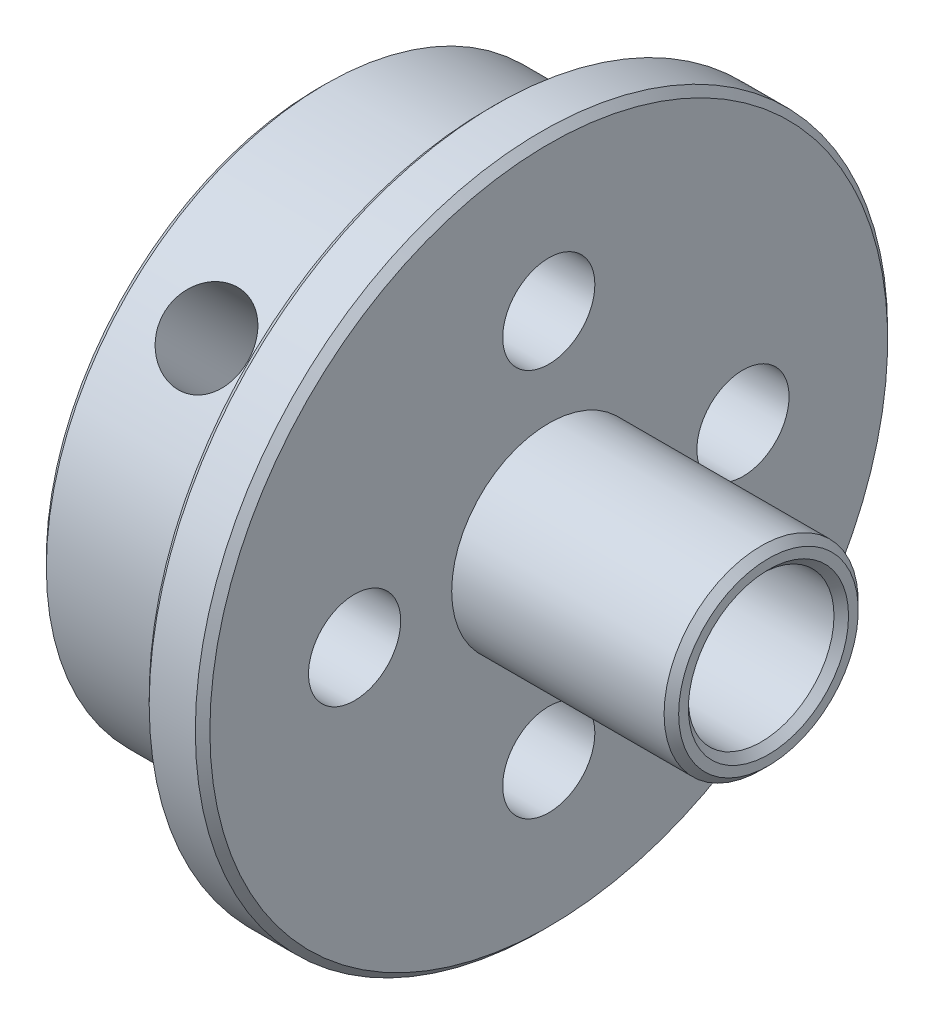
ISO-10303-21;
HEADER;
FILE_DESCRIPTION(('STEP AP214'),'2;1');
FILE_NAME('part.step','',(''),(''),'','','');
FILE_SCHEMA(('AUTOMOTIVE_DESIGN { 1 0 10303 214 1 1 1 1 }'));
ENDSEC;
DATA;
#1=APPLICATION_CONTEXT('core data for automotive mechanical design processes');
#2=APPLICATION_PROTOCOL_DEFINITION('international standard','automotive_design',2000,#1);
#3=PRODUCT_CONTEXT('',#1,'mechanical');
#4=PRODUCT('Part','Part','',(#3));
#5=PRODUCT_RELATED_PRODUCT_CATEGORY('part','',(#4));
#6=PRODUCT_DEFINITION_FORMATION('','',#4);
#7=PRODUCT_DEFINITION_CONTEXT('part definition',#1,'design');
#8=PRODUCT_DEFINITION('design','',#6,#7);
#9=PRODUCT_DEFINITION_SHAPE('','',#8);
#10=(LENGTH_UNIT() NAMED_UNIT(*) SI_UNIT(.MILLI.,.METRE.));
#11=(NAMED_UNIT(*) PLANE_ANGLE_UNIT() SI_UNIT($,.RADIAN.));
#12=(NAMED_UNIT(*) SI_UNIT($,.STERADIAN.) SOLID_ANGLE_UNIT());
#13=UNCERTAINTY_MEASURE_WITH_UNIT(LENGTH_MEASURE(1.E-05),#10,'distance_accuracy_value','');
#14=(GEOMETRIC_REPRESENTATION_CONTEXT(3) GLOBAL_UNCERTAINTY_ASSIGNED_CONTEXT((#13)) GLOBAL_UNIT_ASSIGNED_CONTEXT((#10,
#11,#12)) REPRESENTATION_CONTEXT('',''));
#15=CARTESIAN_POINT('',(0.,0.,0.));
#16=DIRECTION('',(0.,0.,1.));
#17=DIRECTION('',(1.,0.,0.));
#18=AXIS2_PLACEMENT_3D('',#15,#16,#17);
#19=CARTESIAN_POINT('',(0.,0.,0.));
#20=DIRECTION('',(-1.,0.,0.));
#21=DIRECTION('',(0.,0.,1.));
#22=AXIS2_PLACEMENT_3D('',#19,#20,#21);
#23=CYLINDRICAL_SURFACE('',#22,11.5);
#24=CARTESIAN_POINT('',(-9.2,0.,0.));
#25=DIRECTION('',(1.,0.,0.));
#26=DIRECTION('',(0.,0.,-1.));
#27=AXIS2_PLACEMENT_3D('',#24,#25,#26);
#28=CIRCLE('',#27,11.5);
#29=CARTESIAN_POINT('',(-9.2,0.,-11.5));
#30=VERTEX_POINT('',#29);
#31=EDGE_CURVE('E62',#30,#30,#28,.T.);
#32=ORIENTED_EDGE('',*,*,#31,.T.);
#33=EDGE_LOOP('',(#32));
#34=FACE_BOUND('',#33,.T.);
#35=CARTESIAN_POINT('',(-6.,6.81817458415801,9.26080424908883));
#36=CARTESIAN_POINT('',(-6.09642872764414,6.81817854052005,9.26080257448462));
#37=CARTESIAN_POINT('',(-6.19291339372761,6.8247808689419,9.2559516418585));
#38=CARTESIAN_POINT('',(-6.38318501015113,6.85093575108356,9.23660834611285));
#39=CARTESIAN_POINT('',(-6.47696923765206,6.87050092878717,9.22210658438797));
#40=CARTESIAN_POINT('',(-6.65905830324152,6.9217672746644,9.18368972584961));
#41=CARTESIAN_POINT('',(-6.74736729025288,6.95345911982339,9.15978186007717));
#42=CARTESIAN_POINT('',(-6.91612250146382,7.0277303954712,9.10292165669288));
#43=CARTESIAN_POINT('',(-6.99656980389278,7.07030833002896,9.0699705617266));
#44=CARTESIAN_POINT('',(-7.14797616114338,7.16510434376142,8.99527303043986));
#45=CARTESIAN_POINT('',(-7.21886296662692,7.21738942421794,8.95346516067613));
#46=CARTESIAN_POINT('',(-7.34851000060077,7.32951048541137,8.86191311272266));
#47=CARTESIAN_POINT('',(-7.40726956176326,7.38934688138393,8.81216849806331));
#48=CARTESIAN_POINT('',(-7.5112607451004,7.51480317326911,8.70543154314447));
#49=CARTESIAN_POINT('',(-7.55642583052685,7.5804495433012,8.64840544040237));
#50=CARTESIAN_POINT('',(-7.63151899232104,7.71506272430739,8.52853562820631));
#51=CARTESIAN_POINT('',(-7.66144787578985,7.78402935918657,8.46569222711816));
#52=CARTESIAN_POINT('',(-7.70500003067391,7.92252153425317,8.33622015234762));
#53=CARTESIAN_POINT('',(-7.71874428717648,7.99203896540362,8.26962351544998));
#54=CARTESIAN_POINT('',(-7.72991271218585,8.13001649549902,8.13401412124361));
#55=CARTESIAN_POINT('',(-7.72733779014373,8.1984766531516,8.06500149878844));
#56=CARTESIAN_POINT('',(-7.70603641544544,8.33184546073385,7.92713567360147));
#57=CARTESIAN_POINT('',(-7.68744012478527,8.39677826017712,7.85828565828065));
#58=CARTESIAN_POINT('',(-7.63482821321521,8.52201622930709,7.72229177081329));
#59=CARTESIAN_POINT('',(-7.60081219462002,8.58232127959409,7.65514794271764));
#60=CARTESIAN_POINT('',(-7.51819320731742,8.69713409078544,7.5244575289156));
#61=CARTESIAN_POINT('',(-7.46953545558073,8.75161901936677,7.46092553752131));
#62=CARTESIAN_POINT('',(-7.35905421677062,8.85341663204186,7.33984200058632));
#63=CARTESIAN_POINT('',(-7.29722986087831,8.9007288424798,7.28229085007381));
#64=CARTESIAN_POINT('',(-7.16144531959408,8.9877465578854,7.17462612799933));
#65=CARTESIAN_POINT('',(-7.08737149152437,9.02737246580495,7.12459148130544));
#66=CARTESIAN_POINT('',(-6.92957675970303,9.09776185387514,7.03448708690798));
#67=CARTESIAN_POINT('',(-6.84585579626062,9.12852527918584,6.99441740086653));
#68=CARTESIAN_POINT('',(-6.67102633346322,9.18072205025259,6.92576443147103));
#69=CARTESIAN_POINT('',(-6.57991210654787,9.20214807887082,6.89719015770043));
#70=CARTESIAN_POINT('',(-6.39294600484399,9.23530020275009,6.85273714683321));
#71=CARTESIAN_POINT('',(-6.29709446535216,9.24702698346388,6.83685751260003));
#72=CARTESIAN_POINT('',(-6.10437197370602,9.26053522455062,6.8185495150189));
#73=CARTESIAN_POINT('',(-6.00751997647464,9.26241221291593,6.81599194968309));
#74=CARTESIAN_POINT('',(-5.81467357929608,9.25644992403591,6.82408668552968));
#75=CARTESIAN_POINT('',(-5.71867915276177,9.24861094907319,6.83473857574009));
#76=CARTESIAN_POINT('',(-5.53076527363405,9.22340054231299,6.86872053260736));
#77=CARTESIAN_POINT('',(-5.4388277801321,9.20607717223097,6.8919866714389));
#78=CARTESIAN_POINT('',(-5.26106853223601,9.16219097675006,6.95022143341502));
#79=CARTESIAN_POINT('',(-5.17524708083541,9.13562769398149,6.9851906358504));
#80=CARTESIAN_POINT('',(-5.01144379266514,9.07343118554275,7.06579419519126));
#81=CARTESIAN_POINT('',(-4.93352602027353,9.03773101187161,7.11150706209449));
#82=CARTESIAN_POINT('',(-4.7884005011324,8.95793582389579,7.21175985366466));
#83=CARTESIAN_POINT('',(-4.72119336199644,8.91384033363655,7.26630027876491));
#84=CARTESIAN_POINT('',(-4.59882607416581,8.81762377083518,7.38276729982356));
#85=CARTESIAN_POINT('',(-4.54377124370924,8.76543873697966,7.4447517872899));
#86=CARTESIAN_POINT('',(-4.44800518892195,8.65435505315604,7.57359646785078));
#87=CARTESIAN_POINT('',(-4.40729357137407,8.59545658729433,7.64045652722155));
#88=CARTESIAN_POINT('',(-4.34153782425449,8.47250151284391,7.77657322760843));
#89=CARTESIAN_POINT('',(-4.31643613713192,8.40846484856458,7.84582005863276));
#90=CARTESIAN_POINT('',(-4.28242653707968,8.27666178943879,7.98473738812657));
#91=CARTESIAN_POINT('',(-4.27351755177161,8.20889564188749,8.05440785823349));
#92=CARTESIAN_POINT('',(-4.27217247399859,8.07219814790684,8.19139116449172));
#93=CARTESIAN_POINT('',(-4.27957524530074,8.00328481405845,8.25872044815867));
#94=CARTESIAN_POINT('',(-4.3102981211562,7.86568100847884,8.38988080610632));
#95=CARTESIAN_POINT('',(-4.33361817439202,7.79699053602984,8.45371189166454));
#96=CARTESIAN_POINT('',(-4.39545642865356,7.66201652661834,8.57623527885114));
#97=CARTESIAN_POINT('',(-4.43396344459169,7.59573125738638,8.63493132361557));
#98=CARTESIAN_POINT('',(-4.52506534771602,7.46764933071558,8.74593647008587));
#99=CARTESIAN_POINT('',(-4.57766069462073,7.40585281983378,8.79824536329052));
#100=CARTESIAN_POINT('',(-4.69602877486753,7.28826170649499,8.89590618386379));
#101=CARTESIAN_POINT('',(-4.76192046740779,7.23252882901332,8.94118826367201));
#102=CARTESIAN_POINT('',(-4.90476056175067,7.12969845020847,9.02339989152853));
#103=CARTESIAN_POINT('',(-4.98171155490582,7.08260297865642,9.06032747676423));
#104=CARTESIAN_POINT('',(-5.14499573665775,6.99857227843254,9.1253950430916));
#105=CARTESIAN_POINT('',(-5.23137934689139,6.96169579365216,9.15348433734684));
#106=CARTESIAN_POINT('',(-5.41068881345844,6.89994280655271,9.20012499066084));
#107=CARTESIAN_POINT('',(-5.50360776834516,6.87505385690361,9.21868624454205));
#108=CARTESIAN_POINT('',(-5.66411942162941,6.84390952320254,9.24181492529233));
#109=CARTESIAN_POINT('',(-5.73072099340234,6.83427846937976,9.24892979328969));
#110=CARTESIAN_POINT('',(-5.86487256078978,6.82140965514164,9.25842501116616));
#111=CARTESIAN_POINT('',(-5.93242254405105,6.81817181153114,9.260805422655));
#112=CARTESIAN_POINT('',(-6.,6.81817458415801,9.26080424908883));
#113=B_SPLINE_CURVE_WITH_KNOTS('',3,(#35,#36,#37,#38,#39,#40,#41,#42,#43,#44,#45,#46,#47,#48,
#49,#50,#51,#52,#53,#54,#55,#56,#57,#58,#59,#60,#61,#62,#63,#64,#65,#66,#67,#68,#69,#70,#71,#72,
#73,#74,#75,#76,#77,#78,#79,#80,#81,#82,#83,#84,#85,#86,#87,#88,#89,#90,#91,#92,#93,#94,#95,#96,
#97,#98,#99,#100,#101,#102,#103,#104,#105,#106,#107,#108,#109,#110,#111,#112),.UNSPECIFIED.,.T.,
.F.,(4,2,2,2,2,2,2,2,2,2,2,2,2,2,2,2,2,2,2,2,2,2,2,2,2,2,2,2,2,2,2,2,2,2,2,2,2,2,4),(0.,
0.289039178024996,0.578360253933015,0.867459344477231,1.15651872929524,1.44765292141547,
1.73880312955476,2.03135599910802,2.32389336976538,2.61422976390469,2.90454997803691,
3.19253355704969,3.48052456377762,3.76960679710975,4.05870811189724,4.35065980511372,
4.6426133048519,4.93479518080975,5.22695640630195,5.51627880464328,5.80559220182495,
6.0934529075039,6.38132786412921,6.67137574885808,6.96144008213262,7.25392733400486,
7.54640656675625,7.83780086279367,8.12917586023968,8.41768541569528,8.7061940409975,
8.99449057740371,9.28279652240498,9.57380637237164,9.86488452162263,10.1576027734458,
10.4500164206944,10.6525783229463,10.8551375892325),.UNSPECIFIED.);
#114=CARTESIAN_POINT('',(-6.,6.81817458415801,9.26080424908883));
#115=VERTEX_POINT('',#114);
#116=EDGE_CURVE('E77',#115,#115,#113,.T.);
#117=ORIENTED_EDGE('',*,*,#116,.T.);
#118=EDGE_LOOP('',(#117));
#119=FACE_BOUND('',#118,.T.);
#120=CARTESIAN_POINT('',(-2.5,0.,0.));
#121=DIRECTION('',(-1.,0.,0.));
#122=DIRECTION('',(0.,0.,1.));
#123=AXIS2_PLACEMENT_3D('',#120,#121,#122);
#124=CIRCLE('',#123,11.5);
#125=CARTESIAN_POINT('',(-2.5,0.,11.5));
#126=VERTEX_POINT('',#125);
#127=EDGE_CURVE('E85',#126,#126,#124,.T.);
#128=ORIENTED_EDGE('',*,*,#127,.T.);
#129=EDGE_LOOP('',(#128));
#130=FACE_BOUND('',#129,.T.);
#131=ADVANCED_FACE('F33',(#34,#119,#130),#23,.T.);
#132=CARTESIAN_POINT('',(-9.5,3.,0.));
#133=DIRECTION('',(1.,0.,0.));
#134=DIRECTION('',(0.,0.,-1.));
#135=AXIS2_PLACEMENT_3D('',#132,#133,#134);
#136=PLANE('',#135);
#137=CARTESIAN_POINT('',(-9.5,0.,0.));
#138=DIRECTION('',(1.,0.,0.));
#139=DIRECTION('',(0.,0.,-1.));
#140=AXIS2_PLACEMENT_3D('',#137,#138,#139);
#141=CIRCLE('',#140,3.3);
#142=CARTESIAN_POINT('',(-9.5,0.,-3.3));
#143=VERTEX_POINT('',#142);
#144=EDGE_CURVE('E65',#143,#143,#141,.T.);
#145=ORIENTED_EDGE('',*,*,#144,.T.);
#146=EDGE_LOOP('',(#145));
#147=FACE_BOUND('',#146,.T.);
#148=CARTESIAN_POINT('',(-9.5,0.,0.));
#149=DIRECTION('',(1.,0.,0.));
#150=DIRECTION('',(0.,0.,-1.));
#151=AXIS2_PLACEMENT_3D('',#148,#149,#150);
#152=CIRCLE('',#151,11.2);
#153=CARTESIAN_POINT('',(-9.5,0.,-11.2));
#154=VERTEX_POINT('',#153);
#155=EDGE_CURVE('E68',#154,#154,#152,.F.);
#156=ORIENTED_EDGE('',*,*,#155,.T.);
#157=EDGE_LOOP('',(#156));
#158=FACE_BOUND('',#157,.T.);
#159=CARTESIAN_POINT('',(-9.5,8.,0.));
#160=DIRECTION('',(1.,0.,0.));
#161=DIRECTION('',(0.,0.,-1.));
#162=AXIS2_PLACEMENT_3D('',#159,#160,#161);
#163=CIRCLE('',#162,1.89865);
#164=CARTESIAN_POINT('',(-9.5,8.,-1.89865));
#165=VERTEX_POINT('',#164);
#166=EDGE_CURVE('E169',#165,#165,#163,.T.);
#167=ORIENTED_EDGE('',*,*,#166,.T.);
#168=EDGE_LOOP('',(#167));
#169=FACE_BOUND('',#168,.T.);
#170=CARTESIAN_POINT('',(-9.5,-8.,0.));
#171=DIRECTION('',(1.,0.,0.));
#172=DIRECTION('',(0.,0.,-1.));
#173=AXIS2_PLACEMENT_3D('',#170,#171,#172);
#174=CIRCLE('',#173,1.89865);
#175=CARTESIAN_POINT('',(-9.5,-8.,-1.89865));
#176=VERTEX_POINT('',#175);
#177=EDGE_CURVE('E164',#176,#176,#174,.T.);
#178=ORIENTED_EDGE('',*,*,#177,.T.);
#179=EDGE_LOOP('',(#178));
#180=FACE_BOUND('',#179,.T.);
#181=CARTESIAN_POINT('',(-9.5,0.,-8.));
#182=DIRECTION('',(1.,0.,0.));
#183=DIRECTION('',(0.,0.,-1.));
#184=AXIS2_PLACEMENT_3D('',#181,#182,#183);
#185=CIRCLE('',#184,1.89865);
#186=CARTESIAN_POINT('',(-9.5,0.,-9.89865));
#187=VERTEX_POINT('',#186);
#188=EDGE_CURVE('E158',#187,#187,#185,.T.);
#189=ORIENTED_EDGE('',*,*,#188,.T.);
#190=EDGE_LOOP('',(#189));
#191=FACE_BOUND('',#190,.T.);
#192=CARTESIAN_POINT('',(-9.5,0.,8.));
#193=DIRECTION('',(1.,0.,0.));
#194=DIRECTION('',(0.,0.,-1.));
#195=AXIS2_PLACEMENT_3D('',#192,#193,#194);
#196=CIRCLE('',#195,1.89865);
#197=CARTESIAN_POINT('',(-9.5,0.,6.10135));
#198=VERTEX_POINT('',#197);
#199=EDGE_CURVE('E149',#198,#198,#196,.T.);
#200=ORIENTED_EDGE('',*,*,#199,.T.);
#201=EDGE_LOOP('',(#200));
#202=FACE_BOUND('',#201,.T.);
#203=ADVANCED_FACE('F130',(#147,#158,#169,#180,#191,#202),#136,.F.);
#204=CARTESIAN_POINT('',(-2.5,14.2621,0.));
#205=DIRECTION('',(1.,0.,0.));
#206=DIRECTION('',(0.,0.,-1.));
#207=AXIS2_PLACEMENT_3D('',#204,#205,#206);
#208=PLANE('',#207);
#209=CARTESIAN_POINT('',(-2.5,0.,0.));
#210=DIRECTION('',(1.,0.,0.));
#211=DIRECTION('',(0.,0.,-1.));
#212=AXIS2_PLACEMENT_3D('',#209,#210,#211);
#213=CIRCLE('',#212,13.9621);
#214=CARTESIAN_POINT('',(-2.5,0.,-13.9621));
#215=VERTEX_POINT('',#214);
#216=EDGE_CURVE('E59',#215,#215,#213,.F.);
#217=ORIENTED_EDGE('',*,*,#216,.T.);
#218=EDGE_LOOP('',(#217));
#219=FACE_BOUND('',#218,.T.);
#220=ORIENTED_EDGE('',*,*,#127,.F.);
#221=EDGE_LOOP('',(#220));
#222=FACE_BOUND('',#221,.T.);
#223=ADVANCED_FACE('F127',(#219,#222),#208,.F.);
#224=CARTESIAN_POINT('',(0.,0.,0.));
#225=DIRECTION('',(-1.,0.,0.));
#226=DIRECTION('',(0.,0.,1.));
#227=AXIS2_PLACEMENT_3D('',#224,#225,#226);
#228=CYLINDRICAL_SURFACE('',#227,14.2621);
#229=CARTESIAN_POINT('',(-2.19999999999998,0.,0.));
#230=DIRECTION('',(1.,0.,0.));
#231=DIRECTION('',(0.,0.,-1.));
#232=AXIS2_PLACEMENT_3D('',#229,#230,#231);
#233=CIRCLE('',#232,14.2621);
#234=CARTESIAN_POINT('',(-2.19999999999998,0.,-14.2621));
#235=VERTEX_POINT('',#234);
#236=EDGE_CURVE('E53',#235,#235,#233,.T.);
#237=ORIENTED_EDGE('',*,*,#236,.T.);
#238=EDGE_LOOP('',(#237));
#239=FACE_BOUND('',#238,.T.);
#240=CARTESIAN_POINT('',(-0.299999999999996,0.,0.));
#241=DIRECTION('',(-1.,0.,0.));
#242=DIRECTION('',(0.,0.,1.));
#243=AXIS2_PLACEMENT_3D('',#240,#241,#242);
#244=CIRCLE('',#243,14.2621);
#245=CARTESIAN_POINT('',(-0.299999999999996,0.,14.2621));
#246=VERTEX_POINT('',#245);
#247=EDGE_CURVE('E56',#246,#246,#244,.T.);
#248=ORIENTED_EDGE('',*,*,#247,.T.);
#249=EDGE_LOOP('',(#248));
#250=FACE_BOUND('',#249,.T.);
#251=ADVANCED_FACE('F124',(#239,#250),#228,.T.);
#252=CARTESIAN_POINT('',(0.,14.2621,0.));
#253=DIRECTION('',(-1.,0.,0.));
#254=DIRECTION('',(0.,0.,1.));
#255=AXIS2_PLACEMENT_3D('',#252,#253,#254);
#256=PLANE('',#255);
#257=CARTESIAN_POINT('',(0.,0.,0.));
#258=DIRECTION('',(-1.,0.,0.));
#259=DIRECTION('',(0.,0.,1.));
#260=AXIS2_PLACEMENT_3D('',#257,#258,#259);
#261=CIRCLE('',#260,13.9621);
#262=CARTESIAN_POINT('',(0.,0.,13.9621));
#263=VERTEX_POINT('',#262);
#264=EDGE_CURVE('E48',#263,#263,#261,.F.);
#265=ORIENTED_EDGE('',*,*,#264,.T.);
#266=EDGE_LOOP('',(#265));
#267=FACE_BOUND('',#266,.T.);
#268=CARTESIAN_POINT('',(0.,8.,0.));
#269=DIRECTION('',(1.,0.,0.));
#270=DIRECTION('',(0.,0.,-1.));
#271=AXIS2_PLACEMENT_3D('',#268,#269,#270);
#272=CIRCLE('',#271,1.89865);
#273=CARTESIAN_POINT('',(0.,8.,-1.89865));
#274=VERTEX_POINT('',#273);
#275=EDGE_CURVE('E107',#274,#274,#272,.T.);
#276=ORIENTED_EDGE('',*,*,#275,.F.);
#277=EDGE_LOOP('',(#276));
#278=FACE_BOUND('',#277,.T.);
#279=CARTESIAN_POINT('',(0.,-8.,0.));
#280=DIRECTION('',(1.,0.,0.));
#281=DIRECTION('',(0.,0.,-1.));
#282=AXIS2_PLACEMENT_3D('',#279,#280,#281);
#283=CIRCLE('',#282,1.89865);
#284=CARTESIAN_POINT('',(0.,-8.,-1.89865));
#285=VERTEX_POINT('',#284);
#286=EDGE_CURVE('E167',#285,#285,#283,.T.);
#287=ORIENTED_EDGE('',*,*,#286,.F.);
#288=EDGE_LOOP('',(#287));
#289=FACE_BOUND('',#288,.T.);
#290=CARTESIAN_POINT('',(0.,0.,-8.));
#291=DIRECTION('',(1.,0.,0.));
#292=DIRECTION('',(0.,0.,-1.));
#293=AXIS2_PLACEMENT_3D('',#290,#291,#292);
#294=CIRCLE('',#293,1.89865);
#295=CARTESIAN_POINT('',(0.,0.,-9.89865));
#296=VERTEX_POINT('',#295);
#297=EDGE_CURVE('E161',#296,#296,#294,.T.);
#298=ORIENTED_EDGE('',*,*,#297,.F.);
#299=EDGE_LOOP('',(#298));
#300=FACE_BOUND('',#299,.T.);
#301=CARTESIAN_POINT('',(0.,0.,8.));
#302=DIRECTION('',(1.,0.,0.));
#303=DIRECTION('',(0.,0.,-1.));
#304=AXIS2_PLACEMENT_3D('',#301,#302,#303);
#305=CIRCLE('',#304,1.89865);
#306=CARTESIAN_POINT('',(0.,0.,6.10135));
#307=VERTEX_POINT('',#306);
#308=EDGE_CURVE('E153',#307,#307,#305,.T.);
#309=ORIENTED_EDGE('',*,*,#308,.F.);
#310=EDGE_LOOP('',(#309));
#311=FACE_BOUND('',#310,.T.);
#312=CARTESIAN_POINT('',(0.,0.,0.));
#313=DIRECTION('',(-1.,0.,0.));
#314=DIRECTION('',(0.,0.,1.));
#315=AXIS2_PLACEMENT_3D('',#312,#313,#314);
#316=CIRCLE('',#315,4.);
#317=CARTESIAN_POINT('',(0.,0.,4.));
#318=VERTEX_POINT('',#317);
#319=EDGE_CURVE('E147',#318,#318,#316,.T.);
#320=ORIENTED_EDGE('',*,*,#319,.T.);
#321=EDGE_LOOP('',(#320));
#322=FACE_BOUND('',#321,.T.);
#323=ADVANCED_FACE('F121',(#267,#278,#289,#300,#311,#322),#256,.F.);
#324=CARTESIAN_POINT('',(0.,0.,0.));
#325=DIRECTION('',(-1.,0.,0.));
#326=DIRECTION('',(0.,0.,1.));
#327=AXIS2_PLACEMENT_3D('',#324,#325,#326);
#328=CYLINDRICAL_SURFACE('',#327,4.);
#329=CARTESIAN_POINT('',(8.74999999999999,0.,0.));
#330=DIRECTION('',(-1.,0.,0.));
#331=DIRECTION('',(0.,0.,1.));
#332=AXIS2_PLACEMENT_3D('',#329,#330,#331);
#333=CIRCLE('',#332,4.);
#334=CARTESIAN_POINT('',(8.74999999999999,0.,4.));
#335=VERTEX_POINT('',#334);
#336=EDGE_CURVE('E11',#335,#335,#333,.T.);
#337=ORIENTED_EDGE('',*,*,#336,.T.);
#338=EDGE_LOOP('',(#337));
#339=FACE_BOUND('',#338,.T.);
#340=ORIENTED_EDGE('',*,*,#319,.F.);
#341=EDGE_LOOP('',(#340));
#342=FACE_BOUND('',#341,.T.);
#343=ADVANCED_FACE('F118',(#339,#342),#328,.T.);
#344=CARTESIAN_POINT('',(9.05,3.,0.));
#345=DIRECTION('',(-1.,0.,0.));
#346=DIRECTION('',(0.,0.,1.));
#347=AXIS2_PLACEMENT_3D('',#344,#345,#346);
#348=PLANE('',#347);
#349=CARTESIAN_POINT('',(9.05,0.,0.));
#350=DIRECTION('',(-1.,0.,0.));
#351=DIRECTION('',(0.,0.,1.));
#352=AXIS2_PLACEMENT_3D('',#349,#350,#351);
#353=CIRCLE('',#352,3.3);
#354=CARTESIAN_POINT('',(9.05,0.,-3.30000000000001));
#355=VERTEX_POINT('',#354);
#356=EDGE_CURVE('E40',#355,#355,#353,.T.);
#357=ORIENTED_EDGE('',*,*,#356,.T.);
#358=EDGE_LOOP('',(#357));
#359=FACE_BOUND('',#358,.T.);
#360=CARTESIAN_POINT('',(9.05,0.,0.));
#361=DIRECTION('',(-1.,0.,0.));
#362=DIRECTION('',(0.,0.,1.));
#363=AXIS2_PLACEMENT_3D('',#360,#361,#362);
#364=CIRCLE('',#363,3.69999999999998);
#365=CARTESIAN_POINT('',(9.05,0.,3.69999999999998));
#366=VERTEX_POINT('',#365);
#367=EDGE_CURVE('E44',#366,#366,#364,.F.);
#368=ORIENTED_EDGE('',*,*,#367,.T.);
#369=EDGE_LOOP('',(#368));
#370=FACE_BOUND('',#369,.T.);
#371=ADVANCED_FACE('F115',(#359,#370),#348,.F.);
#372=CARTESIAN_POINT('',(0.,0.,0.));
#373=DIRECTION('',(-1.,0.,0.));
#374=DIRECTION('',(0.,0.,1.));
#375=AXIS2_PLACEMENT_3D('',#372,#373,#374);
#376=CYLINDRICAL_SURFACE('',#375,3.);
#377=CARTESIAN_POINT('',(-9.19999999999999,0.,0.));
#378=DIRECTION('',(1.,0.,0.));
#379=DIRECTION('',(0.,0.,-1.));
#380=AXIS2_PLACEMENT_3D('',#377,#378,#379);
#381=CIRCLE('',#380,3.);
#382=CARTESIAN_POINT('',(-9.19999999999999,0.,-3.));
#383=VERTEX_POINT('',#382);
#384=EDGE_CURVE('E71',#383,#383,#381,.F.);
#385=ORIENTED_EDGE('',*,*,#384,.T.);
#386=EDGE_LOOP('',(#385));
#387=FACE_BOUND('',#386,.T.);
#388=CARTESIAN_POINT('',(8.75,0.,0.));
#389=DIRECTION('',(-1.,0.,0.));
#390=DIRECTION('',(0.,0.,1.));
#391=AXIS2_PLACEMENT_3D('',#388,#389,#390);
#392=CIRCLE('',#391,3.);
#393=CARTESIAN_POINT('',(8.75,0.,-3.));
#394=VERTEX_POINT('',#393);
#395=EDGE_CURVE('E74',#394,#394,#392,.F.);
#396=ORIENTED_EDGE('',*,*,#395,.T.);
#397=EDGE_LOOP('',(#396));
#398=FACE_BOUND('',#397,.T.);
#399=CARTESIAN_POINT('',(-6.,0.513156291537535,2.95578595646834));
#400=CARTESIAN_POINT('',(-5.91226232935431,0.513158266195781,2.95578646892158));
#401=CARTESIAN_POINT('',(-5.824517092081,0.521291814886618,2.95440810821983));
#402=CARTESIAN_POINT('',(-5.65192166427408,0.552938322357687,2.9486444566044));
#403=CARTESIAN_POINT('',(-5.56707461102145,0.576467424256902,2.94425600920902));
#404=CARTESIAN_POINT('',(-5.40310959065357,0.636518990261702,2.93185360128813));
#405=CARTESIAN_POINT('',(-5.32395788153943,0.672955751110722,2.92386346187037));
#406=CARTESIAN_POINT('',(-5.17208293459383,0.756361355119584,2.90340456263083));
#407=CARTESIAN_POINT('',(-5.09936177530556,0.803333586429952,2.89093436126718));
#408=CARTESIAN_POINT('',(-4.95350070565705,0.911226564359177,2.85887587362854));
#409=CARTESIAN_POINT('',(-4.88121975837857,0.97311894367148,2.83864852387968));
#410=CARTESIAN_POINT('',(-4.7467210104847,1.10434858375482,2.79021714238959));
#411=CARTESIAN_POINT('',(-4.68450990512957,1.17369074720387,2.76200783755609));
#412=CARTESIAN_POINT('',(-4.56597564593263,1.32422016216967,2.6933104388433));
#413=CARTESIAN_POINT('',(-4.51080460680374,1.40590433337988,2.65189837973203));
#414=CARTESIAN_POINT('',(-4.41629258451342,1.57154505466445,2.55720856758604));
#415=CARTESIAN_POINT('',(-4.37693830639572,1.65549963269396,2.50394083874135));
#416=CARTESIAN_POINT('',(-4.31891225341963,1.814286864291,2.39102234484607));
#417=CARTESIAN_POINT('',(-4.29870507134296,1.88926362303653,2.33236903682294));
#418=CARTESIAN_POINT('',(-4.27439050182638,2.03463778669338,2.20668348252714));
#419=CARTESIAN_POINT('',(-4.27026950467854,2.10503901311367,2.13965836879128));
#420=CARTESIAN_POINT('',(-4.27788793384615,2.23085006689717,2.00765189246205));
#421=CARTESIAN_POINT('',(-4.28786617131446,2.28705349237523,1.94331452091875));
#422=CARTESIAN_POINT('',(-4.32010368629814,2.39241676322638,1.81202276450651));
#423=CARTESIAN_POINT('',(-4.34236386836758,2.44157608947199,1.74506818722027));
#424=CARTESIAN_POINT('',(-4.39843417683423,2.53259762653095,1.61016600069143));
#425=CARTESIAN_POINT('',(-4.43234041125853,2.5743945935608,1.54221478230328));
#426=CARTESIAN_POINT('',(-4.51047664998747,2.65020793007321,1.40795953045179));
#427=CARTESIAN_POINT('',(-4.55470964581421,2.6842220393035,1.3416559804654));
#428=CARTESIAN_POINT('',(-4.65796015368069,2.74840604651987,1.20522794159334));
#429=CARTESIAN_POINT('',(-4.71808849201126,2.77769505575697,1.13553013228606));
#430=CARTESIAN_POINT('',(-4.84854028969138,2.82826247703971,1.00298341370333));
#431=CARTESIAN_POINT('',(-4.91887633069087,2.84953088503805,0.940143126706234));
#432=CARTESIAN_POINT('',(-5.07630925341306,2.88707321869059,0.818097665382805));
#433=CARTESIAN_POINT('',(-5.16438404720166,2.90261611115637,0.759917626155645));
#434=CARTESIAN_POINT('',(-5.34996215555269,2.92709215428618,0.659413716316788));
#435=CARTESIAN_POINT('',(-5.44744824257235,2.93603713251813,0.617061539918702));
#436=CARTESIAN_POINT('',(-5.62582419797751,2.94737009018637,0.560043656159898));
#437=CARTESIAN_POINT('',(-5.70532515112768,2.95079717760339,0.541236460224079));
#438=CARTESIAN_POINT('',(-5.86639099754874,2.95512265083407,0.517116487362531));
#439=CARTESIAN_POINT('',(-5.94795377215546,2.95602353380211,0.511790384876632));
#440=CARTESIAN_POINT('',(-6.11083168206113,2.9554437029479,0.515124950732473));
#441=CARTESIAN_POINT('',(-6.19214660541515,2.9539613305855,0.523795359455976));
#442=CARTESIAN_POINT('',(-6.35218226754592,2.94838267589809,0.554321154008511));
#443=CARTESIAN_POINT('',(-6.43090104508262,2.9442844629631,0.576186277489684));
#444=CARTESIAN_POINT('',(-6.58474153671935,2.9328862612002,0.631648224853984));
#445=CARTESIAN_POINT('',(-6.65981582703572,2.92555252816646,0.665367909683631));
#446=CARTESIAN_POINT('',(-6.80431916009393,2.90695935860338,0.742398084716233));
#447=CARTESIAN_POINT('',(-6.87374591056705,2.89569833774337,0.78571244298702));
#448=CARTESIAN_POINT('',(-7.01736080126898,2.86615931332249,0.887925170911445));
#449=CARTESIAN_POINT('',(-7.09038028167892,2.84701871326194,0.948219642328696));
#450=CARTESIAN_POINT('',(-7.22665272202676,2.80103224829446,1.07650758759684));
#451=CARTESIAN_POINT('',(-7.289897304244,2.77417982957242,1.14450758002539));
#452=CARTESIAN_POINT('',(-7.41139292052022,2.7083726987371,1.29304866210574));
#453=CARTESIAN_POINT('',(-7.46843855737284,2.66844906098092,1.37415835923152));
#454=CARTESIAN_POINT('',(-7.56699296634492,2.57680916217415,1.53913294282834));
#455=CARTESIAN_POINT('',(-7.60851380990164,2.52510211398173,1.62299563325695));
#456=CARTESIAN_POINT('',(-7.67122949339574,2.41454481325899,1.78287500025072));
#457=CARTESIAN_POINT('',(-7.69379124255195,2.35660435871339,1.85897994107052));
#458=CARTESIAN_POINT('',(-7.72260808884183,2.23193674563489,2.00693399870249));
#459=CARTESIAN_POINT('',(-7.72887816155777,2.16521771584176,2.07878696457452));
#460=CARTESIAN_POINT('',(-7.72499195399032,2.03366651382967,2.2071785040246));
#461=CARTESIAN_POINT('',(-7.71670087087545,1.9695539127772,2.26452206977988));
#462=CARTESIAN_POINT('',(-7.68762194989945,1.8383928726074,2.37223771265456));
#463=CARTESIAN_POINT('',(-7.66683352043024,1.77134429464408,2.42260945959827));
#464=CARTESIAN_POINT('',(-7.61371579807554,1.63659253053449,2.51560545927194));
#465=CARTESIAN_POINT('',(-7.58139536472766,1.56888988561988,2.55823562169161));
#466=CARTESIAN_POINT('',(-7.50636950390151,1.43485386966717,2.63575354440198));
#467=CARTESIAN_POINT('',(-7.46366132339773,1.36852086668449,2.67063924751202));
#468=CARTESIAN_POINT('',(-7.36376741070167,1.23199895103149,2.73651884745753));
#469=CARTESIAN_POINT('',(-7.30550622603023,1.16218786484745,2.76666323193304));
#470=CARTESIAN_POINT('',(-7.17881072870711,1.02897838563483,2.81892451695466));
#471=CARTESIAN_POINT('',(-7.11036431017463,0.96558777657654,2.84103175562436));
#472=CARTESIAN_POINT('',(-6.9564735396965,0.841457646880449,2.88038679483843));
#473=CARTESIAN_POINT('',(-6.86999155668813,0.781745411923201,2.89685098591367));
#474=CARTESIAN_POINT('',(-6.68740344877031,0.677503067290164,2.92299384222449));
#475=CARTESIAN_POINT('',(-6.5913120178483,0.632950222866077,2.93268269176839));
#476=CARTESIAN_POINT('',(-6.41281132516323,0.570671523818876,2.94535672575513));
#477=CARTESIAN_POINT('',(-6.33175343791775,0.549280754538194,2.94932111304425));
#478=CARTESIAN_POINT('',(-6.16713079766004,0.520529721690699,2.95453402789623));
#479=CARTESIAN_POINT('',(-6.08356883115832,0.513154410704817,2.95578546836421));
#480=CARTESIAN_POINT('',(-6.,0.513156291537535,2.95578595646834));
#481=B_SPLINE_CURVE_WITH_KNOTS('',3,(#399,#400,#401,#402,#403,#404,#405,#406,#407,#408,#409,
#410,#411,#412,#413,#414,#415,#416,#417,#418,#419,#420,#421,#422,#423,#424,#425,#426,#427,#428,
#429,#430,#431,#432,#433,#434,#435,#436,#437,#438,#439,#440,#441,#442,#443,#444,#445,#446,#447,
#448,#449,#450,#451,#452,#453,#454,#455,#456,#457,#458,#459,#460,#461,#462,#463,#464,#465,#466,
#467,#468,#469,#470,#471,#472,#473,#474,#475,#476,#477,#478,#479,#480),.UNSPECIFIED.,.T.,.F.,(4,
2,2,2,2,2,2,2,2,2,2,2,2,2,2,2,2,2,2,2,2,2,2,2,2,2,2,2,2,2,2,2,2,2,2,2,2,2,2,2,4),(0.,
0.262863347498756,0.526002764919042,0.787426784319768,1.04893499712955,1.33962728932968,
1.63051207077494,1.94954197447555,2.26830315032207,2.55854546573899,2.84854216851296,
3.10534984685796,3.36217644138047,3.62117552903758,3.88024973850414,4.16887183597505,
4.45785274862822,4.77631960528617,5.09421417442002,5.33844446100278,5.58243324057435,
5.82659188880224,6.07093094597332,6.31788085386139,6.56493050074796,6.85360499486601,
7.14252554589164,7.46152589712982,7.78027768850507,8.07337623726601,8.36620526945491,
8.62420232001307,8.88221158477688,9.14002305752314,9.39790293166685,9.68413390810054,
9.97070784887139,10.2882594705061,10.6053327345746,10.8559754277832,11.1063488710621),.UNSPECIFIED.);
#482=CARTESIAN_POINT('',(-6.,0.513156291537535,2.95578595646834));
#483=VERTEX_POINT('',#482);
#484=EDGE_CURVE('E100',#483,#483,#481,.T.);
#485=ORIENTED_EDGE('',*,*,#484,.T.);
#486=EDGE_LOOP('',(#485));
#487=FACE_BOUND('',#486,.T.);
#488=ADVANCED_FACE('F109',(#387,#398,#487),#376,.F.);
#489=CARTESIAN_POINT('',(0.,0.,8.));
#490=DIRECTION('',(1.,0.,0.));
#491=DIRECTION('',(0.,0.,-1.));
#492=AXIS2_PLACEMENT_3D('',#489,#490,#491);
#493=CYLINDRICAL_SURFACE('',#492,1.89865);
#494=ORIENTED_EDGE('',*,*,#199,.F.);
#495=EDGE_LOOP('',(#494));
#496=FACE_BOUND('',#495,.T.);
#497=ORIENTED_EDGE('',*,*,#308,.T.);
#498=EDGE_LOOP('',(#497));
#499=FACE_BOUND('',#498,.T.);
#500=ADVANCED_FACE('F114',(#496,#499),#493,.F.);
#501=CARTESIAN_POINT('',(0.,0.,-8.));
#502=DIRECTION('',(1.,0.,0.));
#503=DIRECTION('',(0.,0.,-1.));
#504=AXIS2_PLACEMENT_3D('',#501,#502,#503);
#505=CYLINDRICAL_SURFACE('',#504,1.89865);
#506=ORIENTED_EDGE('',*,*,#188,.F.);
#507=EDGE_LOOP('',(#506));
#508=FACE_BOUND('',#507,.T.);
#509=ORIENTED_EDGE('',*,*,#297,.T.);
#510=EDGE_LOOP('',(#509));
#511=FACE_BOUND('',#510,.T.);
#512=ADVANCED_FACE('F185',(#508,#511),#505,.F.);
#513=CARTESIAN_POINT('',(0.,-8.,0.));
#514=DIRECTION('',(1.,0.,0.));
#515=DIRECTION('',(0.,0.,-1.));
#516=AXIS2_PLACEMENT_3D('',#513,#514,#515);
#517=CYLINDRICAL_SURFACE('',#516,1.89865);
#518=ORIENTED_EDGE('',*,*,#177,.F.);
#519=EDGE_LOOP('',(#518));
#520=FACE_BOUND('',#519,.T.);
#521=ORIENTED_EDGE('',*,*,#286,.T.);
#522=EDGE_LOOP('',(#521));
#523=FACE_BOUND('',#522,.T.);
#524=ADVANCED_FACE('F190',(#520,#523),#517,.F.);
#525=CARTESIAN_POINT('',(0.,8.,0.));
#526=DIRECTION('',(1.,0.,0.));
#527=DIRECTION('',(0.,0.,-1.));
#528=AXIS2_PLACEMENT_3D('',#525,#526,#527);
#529=CYLINDRICAL_SURFACE('',#528,1.89865);
#530=ORIENTED_EDGE('',*,*,#166,.F.);
#531=EDGE_LOOP('',(#530));
#532=FACE_BOUND('',#531,.T.);
#533=ORIENTED_EDGE('',*,*,#275,.T.);
#534=EDGE_LOOP('',(#533));
#535=FACE_BOUND('',#534,.T.);
#536=ADVANCED_FACE('F95',(#532,#535),#529,.F.);
#537=CARTESIAN_POINT('',(-6.,8.13172798364529,8.13172798364531));
#538=DIRECTION('',(0.,0.707106781186546,0.707106781186549));
#539=DIRECTION('',(0.,-0.707106781186549,0.707106781186546));
#540=AXIS2_PLACEMENT_3D('',#537,#538,#539);
#541=CYLINDRICAL_SURFACE('',#540,1.72719999999999);
#542=ORIENTED_EDGE('',*,*,#116,.F.);
#543=EDGE_LOOP('',(#542));
#544=FACE_BOUND('',#543,.T.);
#545=ORIENTED_EDGE('',*,*,#484,.F.);
#546=EDGE_LOOP('',(#545));
#547=FACE_BOUND('',#546,.T.);
#548=ADVANCED_FACE('F90',(#544,#547),#541,.F.);
#549=CARTESIAN_POINT('',(-9.19999999999999,0.,0.));
#550=DIRECTION('',(-1.,0.,0.));
#551=DIRECTION('',(0.,0.,1.));
#552=AXIS2_PLACEMENT_3D('',#549,#550,#551);
#553=CONICAL_SURFACE('',#552,3.,0.785398163397441);
#554=ORIENTED_EDGE('',*,*,#144,.F.);
#555=EDGE_LOOP('',(#554));
#556=FACE_BOUND('',#555,.T.);
#557=ORIENTED_EDGE('',*,*,#384,.F.);
#558=EDGE_LOOP('',(#557));
#559=FACE_BOUND('',#558,.T.);
#560=ADVANCED_FACE('F94',(#556,#559),#553,.F.);
#561=CARTESIAN_POINT('',(-9.5,0.,0.));
#562=DIRECTION('',(1.,0.,0.));
#563=DIRECTION('',(0.,0.,-1.));
#564=AXIS2_PLACEMENT_3D('',#561,#562,#563);
#565=CONICAL_SURFACE('',#564,11.2,0.785398163397443);
#566=ORIENTED_EDGE('',*,*,#31,.F.);
#567=EDGE_LOOP('',(#566));
#568=FACE_BOUND('',#567,.T.);
#569=ORIENTED_EDGE('',*,*,#155,.F.);
#570=EDGE_LOOP('',(#569));
#571=FACE_BOUND('',#570,.T.);
#572=ADVANCED_FACE('F220',(#568,#571),#565,.T.);
#573=CARTESIAN_POINT('',(-2.5,0.,0.));
#574=DIRECTION('',(1.,0.,0.));
#575=DIRECTION('',(0.,0.,-1.));
#576=AXIS2_PLACEMENT_3D('',#573,#574,#575);
#577=CONICAL_SURFACE('',#576,13.9621,0.785398163397445);
#578=ORIENTED_EDGE('',*,*,#236,.F.);
#579=EDGE_LOOP('',(#578));
#580=FACE_BOUND('',#579,.T.);
#581=ORIENTED_EDGE('',*,*,#216,.F.);
#582=EDGE_LOOP('',(#581));
#583=FACE_BOUND('',#582,.T.);
#584=ADVANCED_FACE('F229',(#580,#583),#577,.T.);
#585=CARTESIAN_POINT('',(-0.299999999999996,0.,0.));
#586=DIRECTION('',(-1.,0.,0.));
#587=DIRECTION('',(0.,0.,1.));
#588=AXIS2_PLACEMENT_3D('',#585,#586,#587);
#589=CONICAL_SURFACE('',#588,14.2621,0.785398163397454);
#590=ORIENTED_EDGE('',*,*,#264,.F.);
#591=EDGE_LOOP('',(#590));
#592=FACE_BOUND('',#591,.T.);
#593=ORIENTED_EDGE('',*,*,#247,.F.);
#594=EDGE_LOOP('',(#593));
#595=FACE_BOUND('',#594,.T.);
#596=ADVANCED_FACE('F237',(#592,#595),#589,.T.);
#597=CARTESIAN_POINT('',(9.05,0.,0.));
#598=DIRECTION('',(1.,0.,0.));
#599=DIRECTION('',(0.,0.,-1.));
#600=AXIS2_PLACEMENT_3D('',#597,#598,#599);
#601=CONICAL_SURFACE('',#600,3.3,0.785398163397448);
#602=CARTESIAN_POINT('',(8.75,0.,-3.));
#603=CARTESIAN_POINT('',(8.753125,0.,-3.003125));
#604=CARTESIAN_POINT('',(8.75625,0.,-3.00625));
#605=CARTESIAN_POINT('',(8.7625,0.,-3.0125));
#606=CARTESIAN_POINT('',(8.765625,0.,-3.015625));
#607=CARTESIAN_POINT('',(8.771875,0.,-3.021875));
#608=CARTESIAN_POINT('',(8.775,0.,-3.025));
#609=CARTESIAN_POINT('',(8.78125,0.,-3.03125));
#610=CARTESIAN_POINT('',(8.784375,0.,-3.034375));
#611=CARTESIAN_POINT('',(8.790625,0.,-3.040625));
#612=CARTESIAN_POINT('',(8.79375,0.,-3.04375));
#613=CARTESIAN_POINT('',(8.8,0.,-3.05));
#614=CARTESIAN_POINT('',(8.803125,0.,-3.053125));
#615=CARTESIAN_POINT('',(8.809375,0.,-3.059375));
#616=CARTESIAN_POINT('',(8.8125,0.,-3.0625));
#617=CARTESIAN_POINT('',(8.81875,0.,-3.06875));
#618=CARTESIAN_POINT('',(8.821875,0.,-3.071875));
#619=CARTESIAN_POINT('',(8.828125,0.,-3.078125));
#620=CARTESIAN_POINT('',(8.83125,0.,-3.08125));
#621=CARTESIAN_POINT('',(8.8375,0.,-3.0875));
#622=CARTESIAN_POINT('',(8.840625,0.,-3.090625));
#623=CARTESIAN_POINT('',(8.846875,0.,-3.096875));
#624=CARTESIAN_POINT('',(8.85,0.,-3.1));
#625=CARTESIAN_POINT('',(8.85625,0.,-3.10625));
#626=CARTESIAN_POINT('',(8.859375,0.,-3.109375));
#627=CARTESIAN_POINT('',(8.865625,0.,-3.115625));
#628=CARTESIAN_POINT('',(8.86875,0.,-3.11875));
#629=CARTESIAN_POINT('',(8.875,0.,-3.125));
#630=CARTESIAN_POINT('',(8.878125,0.,-3.128125));
#631=CARTESIAN_POINT('',(8.884375,0.,-3.134375));
#632=CARTESIAN_POINT('',(8.8875,0.,-3.1375));
#633=CARTESIAN_POINT('',(8.89375,0.,-3.14375));
#634=CARTESIAN_POINT('',(8.896875,0.,-3.146875));
#635=CARTESIAN_POINT('',(8.903125,0.,-3.153125));
#636=CARTESIAN_POINT('',(8.90625,0.,-3.15625));
#637=CARTESIAN_POINT('',(8.9125,0.,-3.1625));
#638=CARTESIAN_POINT('',(8.915625,0.,-3.165625));
#639=CARTESIAN_POINT('',(8.921875,0.,-3.171875));
#640=CARTESIAN_POINT('',(8.925,0.,-3.175));
#641=CARTESIAN_POINT('',(8.93125,0.,-3.18125));
#642=CARTESIAN_POINT('',(8.934375,0.,-3.184375));
#643=CARTESIAN_POINT('',(8.940625,0.,-3.190625));
#644=CARTESIAN_POINT('',(8.94375,0.,-3.19375));
#645=CARTESIAN_POINT('',(8.95,0.,-3.2));
#646=CARTESIAN_POINT('',(8.953125,0.,-3.203125));
#647=CARTESIAN_POINT('',(8.959375,0.,-3.209375));
#648=CARTESIAN_POINT('',(8.9625,0.,-3.2125));
#649=CARTESIAN_POINT('',(8.96875,0.,-3.21875));
#650=CARTESIAN_POINT('',(8.971875,0.,-3.221875));
#651=CARTESIAN_POINT('',(8.978125,0.,-3.228125));
#652=CARTESIAN_POINT('',(8.98125,0.,-3.23125));
#653=CARTESIAN_POINT('',(8.9875,0.,-3.2375));
#654=CARTESIAN_POINT('',(8.990625,0.,-3.240625));
#655=CARTESIAN_POINT('',(8.996875,0.,-3.24687500000001));
#656=CARTESIAN_POINT('',(9.,0.,-3.25));
#657=CARTESIAN_POINT('',(9.00625,0.,-3.25625));
#658=CARTESIAN_POINT('',(9.009375,0.,-3.259375));
#659=CARTESIAN_POINT('',(9.015625,0.,-3.265625));
#660=CARTESIAN_POINT('',(9.01875,0.,-3.26875000000001));
#661=CARTESIAN_POINT('',(9.025,0.,-3.27500000000001));
#662=CARTESIAN_POINT('',(9.028125,0.,-3.27812500000001));
#663=CARTESIAN_POINT('',(9.034375,0.,-3.28437500000001));
#664=CARTESIAN_POINT('',(9.0375,0.,-3.28750000000001));
#665=CARTESIAN_POINT('',(9.04375,0.,-3.29375000000001));
#666=CARTESIAN_POINT('',(9.046875,0.,-3.296875));
#667=CARTESIAN_POINT('',(9.05,0.,-3.30000000000001));
#668=B_SPLINE_CURVE_WITH_KNOTS('',3,(#602,#603,#604,#605,#606,#607,#608,#609,#610,#611,#612,
#613,#614,#615,#616,#617,#618,#619,#620,#621,#622,#623,#624,#625,#626,#627,#628,#629,#630,#631,
#632,#633,#634,#635,#636,#637,#638,#639,#640,#641,#642,#643,#644,#645,#646,#647,#648,#649,#650,
#651,#652,#653,#654,#655,#656,#657,#658,#659,#660,#661,#662,#663,#664,#665,#666,#667),
.UNSPECIFIED.,.F.,.F.,(4,2,2,2,2,2,2,2,2,2,2,2,2,2,2,2,2,2,2,2,2,2,2,2,2,2,2,2,2,2,2,2,4),(0.,
0.0132582521472481,0.0265165042944966,0.0397747564417451,0.0530330085889923,0.0662912607362404,
0.0795495128834889,0.0928077650307361,0.106066017177985,0.119324269325233,0.13258252147248,
0.145840773619728,0.159099025766977,0.172357277914224,0.185615530061472,0.198873782208721,
0.212132034355968,0.225390286503216,0.238648538650465,0.251906790797713,0.26516504294496,
0.278423295092208,0.291681547239457,0.304939799386704,0.318198051533952,0.331456303681201,
0.344714555828448,0.357972807975696,0.371231060122944,0.384489312270192,0.39774756441744,
0.411005816564688,0.424264068711936),.UNSPECIFIED.);
#669=EDGE_CURVE('BSEAM245',#394,#355,#668,.T.);
#670=ORIENTED_EDGE('',*,*,#395,.F.);
#671=ORIENTED_EDGE('',*,*,#356,.F.);
#672=ORIENTED_EDGE('',*,*,#669,.T.);
#673=ORIENTED_EDGE('',*,*,#669,.F.);
#674=EDGE_LOOP('',(#670,#672,#671,#673));
#675=FACE_BOUND('',#674,.T.);
#676=ADVANCED_FACE('F245',(#675),#601,.F.);
#677=CARTESIAN_POINT('',(8.74999999999999,0.,0.));
#678=DIRECTION('',(-1.,0.,0.));
#679=DIRECTION('',(0.,0.,1.));
#680=AXIS2_PLACEMENT_3D('',#677,#678,#679);
#681=CONICAL_SURFACE('',#680,4.,0.785398163397451);
#682=ORIENTED_EDGE('',*,*,#367,.F.);
#683=EDGE_LOOP('',(#682));
#684=FACE_BOUND('',#683,.T.);
#685=ORIENTED_EDGE('',*,*,#336,.F.);
#686=EDGE_LOOP('',(#685));
#687=FACE_BOUND('',#686,.T.);
#688=ADVANCED_FACE('F35',(#684,#687),#681,.T.);
#689=CLOSED_SHELL('',(#131,#203,#223,#251,#323,#343,#371,#488,#500,#512,#524,#536,#548,#560,
#572,#584,#596,#676,#688));
#690=MANIFOLD_SOLID_BREP('B2',#689);
#691=ADVANCED_BREP_SHAPE_REPRESENTATION('',(#18,#690),#14);
#692=SHAPE_DEFINITION_REPRESENTATION(#9,#691);
ENDSEC;
END-ISO-10303-21;
